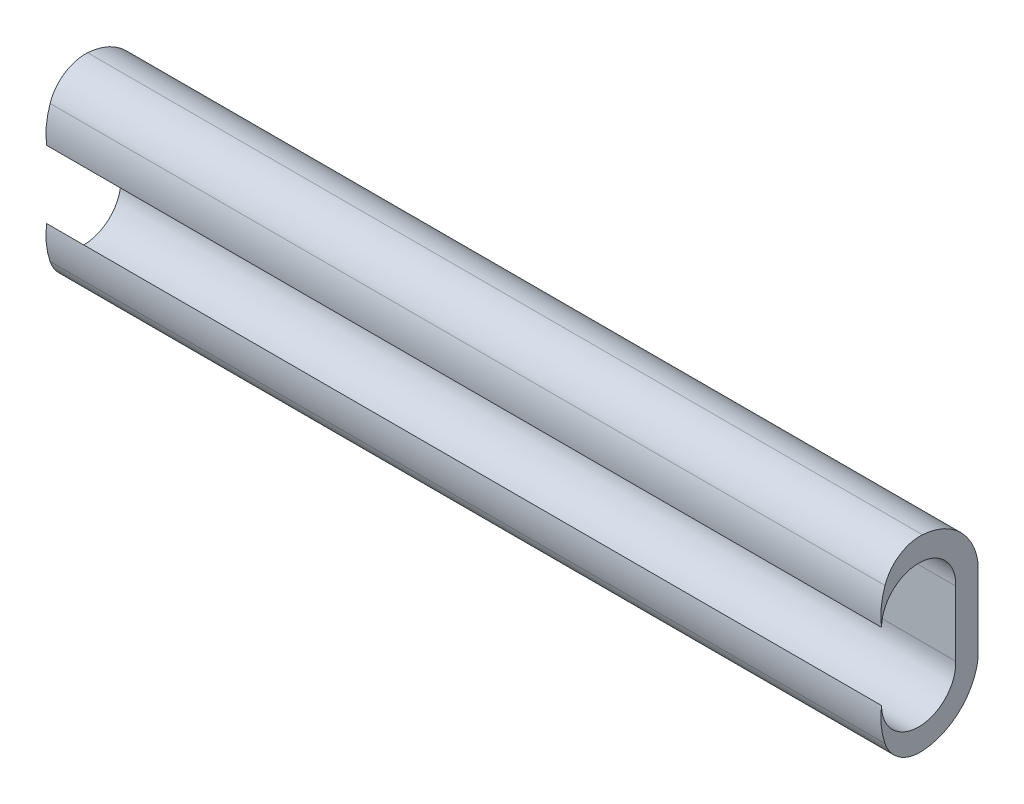
ISO-10303-21;
HEADER;
FILE_DESCRIPTION(('STEP AP214'),'2;1');
FILE_NAME('part.step','',(''),(''),'','','');
FILE_SCHEMA(('AUTOMOTIVE_DESIGN { 1 0 10303 214 1 1 1 1 }'));
ENDSEC;
DATA;
#1=APPLICATION_CONTEXT('core data for automotive mechanical design processes');
#2=APPLICATION_PROTOCOL_DEFINITION('international standard','automotive_design',2000,#1);
#3=PRODUCT_CONTEXT('',#1,'mechanical');
#4=PRODUCT('Part','Part','',(#3));
#5=PRODUCT_RELATED_PRODUCT_CATEGORY('part','',(#4));
#6=PRODUCT_DEFINITION_FORMATION('','',#4);
#7=PRODUCT_DEFINITION_CONTEXT('part definition',#1,'design');
#8=PRODUCT_DEFINITION('design','',#6,#7);
#9=PRODUCT_DEFINITION_SHAPE('','',#8);
#10=(LENGTH_UNIT() NAMED_UNIT(*) SI_UNIT(.MILLI.,.METRE.));
#11=(NAMED_UNIT(*) PLANE_ANGLE_UNIT() SI_UNIT($,.RADIAN.));
#12=(NAMED_UNIT(*) SI_UNIT($,.STERADIAN.) SOLID_ANGLE_UNIT());
#13=UNCERTAINTY_MEASURE_WITH_UNIT(LENGTH_MEASURE(1.E-05),#10,'distance_accuracy_value','');
#14=(GEOMETRIC_REPRESENTATION_CONTEXT(3) GLOBAL_UNCERTAINTY_ASSIGNED_CONTEXT((#13)) GLOBAL_UNIT_ASSIGNED_CONTEXT((#10,
#11,#12)) REPRESENTATION_CONTEXT('',''));
#15=CARTESIAN_POINT('',(0.,0.,0.));
#16=DIRECTION('',(0.,0.,1.));
#17=DIRECTION('',(1.,0.,0.));
#18=AXIS2_PLACEMENT_3D('',#15,#16,#17);
#19=CARTESIAN_POINT('',(-45.,3.04837819199576,1.91991245588261));
#20=DIRECTION('',(1.,0.,0.));
#21=DIRECTION('',(0.,0.,-1.));
#22=AXIS2_PLACEMENT_3D('',#19,#20,#21);
#23=CYLINDRICAL_SURFACE('',#22,2.);
#24=CARTESIAN_POINT('',(0.,3.04837819199576,1.91991245588261));
#25=DIRECTION('',(1.,0.,0.));
#26=DIRECTION('',(0.,0.,-1.));
#27=AXIS2_PLACEMENT_3D('',#24,#25,#26);
#28=CIRCLE('',#27,2.);
#29=CARTESIAN_POINT('',(0.,3.68763119707454,3.81499968223863));
#30=VERTEX_POINT('',#29);
#31=CARTESIAN_POINT('',(0.,5.04424708328357,1.79143145032311));
#32=VERTEX_POINT('',#31);
#33=EDGE_CURVE('E135',#30,#32,#28,.F.);
#34=ORIENTED_EDGE('',*,*,#33,.T.);
#35=DIRECTION('',(1.,0.,0.));
#36=VECTOR('',#35,1.);
#37=CARTESIAN_POINT('',(-45.,5.04424708328357,1.79143145032311));
#38=LINE('',#37,#36);
#39=CARTESIAN_POINT('',(-45.,5.04424708328357,1.79143145032311));
#40=VERTEX_POINT('',#39);
#41=EDGE_CURVE('E11',#40,#32,#38,.T.);
#42=ORIENTED_EDGE('',*,*,#41,.F.);
#43=CARTESIAN_POINT('',(-45.,3.04837819199576,1.91991245588261));
#44=DIRECTION('',(1.,0.,0.));
#45=DIRECTION('',(0.,0.,-1.));
#46=AXIS2_PLACEMENT_3D('',#43,#44,#45);
#47=CIRCLE('',#46,2.);
#48=CARTESIAN_POINT('',(-45.,3.68763119707454,3.81499968223863));
#49=VERTEX_POINT('',#48);
#50=EDGE_CURVE('E57',#49,#40,#47,.F.);
#51=ORIENTED_EDGE('',*,*,#50,.F.);
#52=DIRECTION('',(1.,0.,0.));
#53=VECTOR('',#52,1.);
#54=CARTESIAN_POINT('',(-45.,3.68763119707454,3.81499968223863));
#55=LINE('',#54,#53);
#56=EDGE_CURVE('E42',#49,#30,#55,.T.);
#57=ORIENTED_EDGE('',*,*,#56,.T.);
#58=EDGE_LOOP('',(#34,#42,#51,#57));
#59=FACE_BOUND('',#58,.T.);
#60=ADVANCED_FACE('F39',(#59),#23,.T.);
#61=CARTESIAN_POINT('',(-45.,1.82392596743135,1.99873469403578));
#62=DIRECTION('',(1.,0.,0.));
#63=DIRECTION('',(0.,0.,-1.));
#64=AXIS2_PLACEMENT_3D('',#61,#62,#63);
#65=CYLINDRICAL_SURFACE('',#64,3.22698663214732);
#66=CARTESIAN_POINT('',(0.,1.82392596743135,1.99873469403578));
#67=DIRECTION('',(1.,0.,0.));
#68=DIRECTION('',(0.,0.,-1.));
#69=AXIS2_PLACEMENT_3D('',#66,#67,#68);
#70=CIRCLE('',#69,3.22698663214732);
#71=CARTESIAN_POINT('',(0.,2.25,-1.2));
#72=VERTEX_POINT('',#71);
#73=EDGE_CURVE('E151',#72,#32,#70,.T.);
#74=ORIENTED_EDGE('',*,*,#73,.F.);
#75=DIRECTION('',(1.,0.,0.));
#76=VECTOR('',#75,1.);
#77=CARTESIAN_POINT('',(-45.,2.25,-1.2));
#78=LINE('',#77,#76);
#79=CARTESIAN_POINT('',(-45.,2.25,-1.2));
#80=VERTEX_POINT('',#79);
#81=EDGE_CURVE('E48',#80,#72,#78,.T.);
#82=ORIENTED_EDGE('',*,*,#81,.F.);
#83=CARTESIAN_POINT('',(-45.,1.82392596743135,1.99873469403578));
#84=DIRECTION('',(1.,0.,0.));
#85=DIRECTION('',(0.,0.,-1.));
#86=AXIS2_PLACEMENT_3D('',#83,#84,#85);
#87=CIRCLE('',#86,3.22698663214732);
#88=EDGE_CURVE('E133',#80,#40,#87,.T.);
#89=ORIENTED_EDGE('',*,*,#88,.T.);
#90=ORIENTED_EDGE('',*,*,#41,.T.);
#91=EDGE_LOOP('',(#74,#82,#89,#90));
#92=FACE_BOUND('',#91,.T.);
#93=ADVANCED_FACE('F167',(#92),#65,.T.);
#94=CARTESIAN_POINT('',(-45.,0.,-1.2));
#95=DIRECTION('',(0.,0.,-1.));
#96=DIRECTION('',(-1.,0.,0.));
#97=AXIS2_PLACEMENT_3D('',#94,#95,#96);
#98=PLANE('',#97);
#99=DIRECTION('',(0.,1.,0.));
#100=VECTOR('',#99,1.);
#101=CARTESIAN_POINT('',(0.,0.,-1.2));
#102=LINE('',#101,#100);
#103=CARTESIAN_POINT('',(0.,-2.25,-1.2));
#104=VERTEX_POINT('',#103);
#105=EDGE_CURVE('E149',#104,#72,#102,.T.);
#106=ORIENTED_EDGE('',*,*,#105,.F.);
#107=DIRECTION('',(1.,0.,0.));
#108=VECTOR('',#107,1.);
#109=CARTESIAN_POINT('',(-45.,-2.25,-1.2));
#110=LINE('',#109,#108);
#111=CARTESIAN_POINT('',(-45.,-2.25,-1.2));
#112=VERTEX_POINT('',#111);
#113=EDGE_CURVE('E322',#112,#104,#110,.T.);
#114=ORIENTED_EDGE('',*,*,#113,.F.);
#115=DIRECTION('',(0.,1.,0.));
#116=VECTOR('',#115,1.);
#117=CARTESIAN_POINT('',(-45.,0.,-1.2));
#118=LINE('',#117,#116);
#119=EDGE_CURVE('E111',#112,#80,#118,.T.);
#120=ORIENTED_EDGE('',*,*,#119,.T.);
#121=ORIENTED_EDGE('',*,*,#81,.T.);
#122=EDGE_LOOP('',(#106,#114,#120,#121));
#123=FACE_BOUND('',#122,.T.);
#124=ADVANCED_FACE('F171',(#123),#98,.T.);
#125=CARTESIAN_POINT('',(-45.,0.,0.));
#126=DIRECTION('',(0.,0.,-1.));
#127=DIRECTION('',(-1.,0.,0.));
#128=AXIS2_PLACEMENT_3D('',#125,#126,#127);
#129=PLANE('',#128);
#130=DIRECTION('',(0.,1.,0.));
#131=VECTOR('',#130,1.);
#132=CARTESIAN_POINT('',(0.,0.,0.));
#133=LINE('',#132,#131);
#134=CARTESIAN_POINT('',(0.,-1.75279494144631,0.));
#135=VERTEX_POINT('',#134);
#136=CARTESIAN_POINT('',(0.,1.75279494144631,0.));
#137=VERTEX_POINT('',#136);
#138=EDGE_CURVE('E117',#135,#137,#133,.T.);
#139=ORIENTED_EDGE('',*,*,#138,.T.);
#140=DIRECTION('',(1.,0.,0.));
#141=VECTOR('',#140,1.);
#142=CARTESIAN_POINT('',(-45.,1.75279494144631,0.));
#143=LINE('',#142,#141);
#144=CARTESIAN_POINT('',(-45.,1.75279494144631,0.));
#145=VERTEX_POINT('',#144);
#146=EDGE_CURVE('E114',#145,#137,#143,.T.);
#147=ORIENTED_EDGE('',*,*,#146,.F.);
#148=DIRECTION('',(0.,1.,0.));
#149=VECTOR('',#148,1.);
#150=CARTESIAN_POINT('',(-45.,0.,0.));
#151=LINE('',#150,#149);
#152=CARTESIAN_POINT('',(-45.,-1.75279494144631,0.));
#153=VERTEX_POINT('',#152);
#154=EDGE_CURVE('E98',#153,#145,#151,.T.);
#155=ORIENTED_EDGE('',*,*,#154,.F.);
#156=DIRECTION('',(1.,0.,0.));
#157=VECTOR('',#156,1.);
#158=CARTESIAN_POINT('',(-45.,-1.75279494144631,0.));
#159=LINE('',#158,#157);
#160=EDGE_CURVE('E325',#153,#135,#159,.T.);
#161=ORIENTED_EDGE('',*,*,#160,.T.);
#162=EDGE_LOOP('',(#139,#147,#155,#161));
#163=FACE_BOUND('',#162,.T.);
#164=ADVANCED_FACE('F115',(#163),#129,.F.);
#165=CARTESIAN_POINT('',(-45.,1.82392596743135,1.99873469403578));
#166=DIRECTION('',(1.,0.,0.));
#167=DIRECTION('',(0.,0.,-1.));
#168=AXIS2_PLACEMENT_3D('',#165,#166,#167);
#169=CYLINDRICAL_SURFACE('',#168,2.);
#170=CARTESIAN_POINT('',(0.,1.82392596743135,1.99873469403578));
#171=DIRECTION('',(1.,0.,0.));
#172=DIRECTION('',(0.,0.,-1.));
#173=AXIS2_PLACEMENT_3D('',#170,#171,#172);
#174=CIRCLE('',#173,2.);
#175=CARTESIAN_POINT('',(0.,1.82392596743134,3.99873469403578));
#176=VERTEX_POINT('',#175);
#177=EDGE_CURVE('E143',#137,#176,#174,.T.);
#178=ORIENTED_EDGE('',*,*,#177,.T.);
#179=DIRECTION('',(1.,0.,0.));
#180=VECTOR('',#179,1.);
#181=CARTESIAN_POINT('',(-45.,1.82392596743134,3.99873469403578));
#182=LINE('',#181,#180);
#183=CARTESIAN_POINT('',(-45.,1.82392596743134,3.99873469403578));
#184=VERTEX_POINT('',#183);
#185=EDGE_CURVE('E121',#184,#176,#182,.T.);
#186=ORIENTED_EDGE('',*,*,#185,.F.);
#187=CARTESIAN_POINT('',(-45.,1.82392596743135,1.99873469403578));
#188=DIRECTION('',(1.,0.,0.));
#189=DIRECTION('',(0.,0.,-1.));
#190=AXIS2_PLACEMENT_3D('',#187,#188,#189);
#191=CIRCLE('',#190,2.);
#192=EDGE_CURVE('E102',#145,#184,#191,.T.);
#193=ORIENTED_EDGE('',*,*,#192,.F.);
#194=ORIENTED_EDGE('',*,*,#146,.T.);
#195=EDGE_LOOP('',(#178,#186,#193,#194));
#196=FACE_BOUND('',#195,.T.);
#197=ADVANCED_FACE('F123',(#196),#169,.F.);
#198=CARTESIAN_POINT('',(-45.,3.68763119707454,3.81499968223863));
#199=CARTESIAN_POINT('',(-45.,2.71633840059157,4.14263728663376));
#200=CARTESIAN_POINT('',(-45.,1.71378640995213,4.10335856162983));
#201=CARTESIAN_POINT('',(-45.,0.793955669736873,3.71313289336614));
#202=B_SPLINE_CURVE_WITH_KNOTS('',3,(#198,#199,#200,#201),.UNSPECIFIED.,.F.,.F.,(4,4),
(0.27184632039241,1.),.UNSPECIFIED.);
#203=DIRECTION('',(1.,0.,0.));
#204=VECTOR('',#203,1.);
#205=SURFACE_OF_LINEAR_EXTRUSION('',#202,#204);
#206=CARTESIAN_POINT('',(0.,3.68763119707454,3.81499968223863));
#207=CARTESIAN_POINT('',(0.,2.71633840059157,4.14263728663376));
#208=CARTESIAN_POINT('',(0.,1.71378640995213,4.10335856162983));
#209=CARTESIAN_POINT('',(0.,0.793955669736873,3.71313289336614));
#210=B_SPLINE_CURVE_WITH_KNOTS('',3,(#206,#207,#208,#209),.UNSPECIFIED.,.F.,.F.,(4,4),
(0.27184632039241,1.),.UNSPECIFIED.);
#211=EDGE_CURVE('E137',#30,#176,#210,.T.);
#212=ORIENTED_EDGE('',*,*,#211,.F.);
#213=ORIENTED_EDGE('',*,*,#56,.F.);
#214=EDGE_CURVE('E124',#49,#184,#202,.T.);
#215=ORIENTED_EDGE('',*,*,#214,.T.);
#216=ORIENTED_EDGE('',*,*,#185,.T.);
#217=EDGE_LOOP('',(#212,#213,#215,#216));
#218=FACE_BOUND('',#217,.T.);
#219=ADVANCED_FACE('F158',(#218),#205,.T.);
#220=CARTESIAN_POINT('',(-45.,0.,0.));
#221=DIRECTION('',(1.,0.,0.));
#222=DIRECTION('',(0.,0.,-1.));
#223=AXIS2_PLACEMENT_3D('',#220,#221,#222);
#224=PLANE('',#223);
#225=ORIENTED_EDGE('',*,*,#50,.T.);
#226=ORIENTED_EDGE('',*,*,#88,.F.);
#227=ORIENTED_EDGE('',*,*,#119,.F.);
#228=CARTESIAN_POINT('',(-45.,-1.82392596743135,1.99873469403578));
#229=DIRECTION('',(-1.,0.,0.));
#230=DIRECTION('',(0.,0.,-1.));
#231=AXIS2_PLACEMENT_3D('',#228,#229,#230);
#232=CIRCLE('',#231,3.22698663214732);
#233=CARTESIAN_POINT('',(-45.,-5.04424708328357,1.79143145032311));
#234=VERTEX_POINT('',#233);
#235=EDGE_CURVE('E300',#112,#234,#232,.T.);
#236=ORIENTED_EDGE('',*,*,#235,.T.);
#237=CARTESIAN_POINT('',(-45.,-3.04837819199576,1.91991245588261));
#238=DIRECTION('',(-1.,0.,0.));
#239=DIRECTION('',(0.,0.,-1.));
#240=AXIS2_PLACEMENT_3D('',#237,#238,#239);
#241=CIRCLE('',#240,2.);
#242=CARTESIAN_POINT('',(-45.,-3.68763119707454,3.81499968223863));
#243=VERTEX_POINT('',#242);
#244=EDGE_CURVE('E295',#243,#234,#241,.F.);
#245=ORIENTED_EDGE('',*,*,#244,.F.);
#246=CARTESIAN_POINT('',(-45.,-3.68763119707454,3.81499968223863));
#247=CARTESIAN_POINT('',(-45.,-2.71633840059157,4.14263728663376));
#248=CARTESIAN_POINT('',(-45.,-1.71378640995213,4.10335856162983));
#249=CARTESIAN_POINT('',(-45.,-0.793955669736873,3.71313289336614));
#250=B_SPLINE_CURVE_WITH_KNOTS('',3,(#246,#247,#248,#249),.UNSPECIFIED.,.F.,.F.,(4,4),
(0.27184632039241,1.),.UNSPECIFIED.);
#251=CARTESIAN_POINT('',(-45.,-1.82392596743134,3.99873469403578));
#252=VERTEX_POINT('',#251);
#253=EDGE_CURVE('E289',#243,#252,#250,.T.);
#254=ORIENTED_EDGE('',*,*,#253,.T.);
#255=CARTESIAN_POINT('',(-45.,-1.82392596743135,1.99873469403578));
#256=DIRECTION('',(-1.,0.,0.));
#257=DIRECTION('',(0.,0.,-1.));
#258=AXIS2_PLACEMENT_3D('',#255,#256,#257);
#259=CIRCLE('',#258,2.);
#260=EDGE_CURVE('E107',#153,#252,#259,.T.);
#261=ORIENTED_EDGE('',*,*,#260,.F.);
#262=ORIENTED_EDGE('',*,*,#154,.T.);
#263=ORIENTED_EDGE('',*,*,#192,.T.);
#264=ORIENTED_EDGE('',*,*,#214,.F.);
#265=EDGE_LOOP('',(#225,#226,#227,#236,#245,#254,#261,#262,#263,#264));
#266=FACE_BOUND('',#265,.T.);
#267=ADVANCED_FACE('F100',(#266),#224,.F.);
#268=CARTESIAN_POINT('',(0.,0.,0.));
#269=DIRECTION('',(1.,0.,0.));
#270=DIRECTION('',(0.,0.,-1.));
#271=AXIS2_PLACEMENT_3D('',#268,#269,#270);
#272=PLANE('',#271);
#273=ORIENTED_EDGE('',*,*,#33,.F.);
#274=ORIENTED_EDGE('',*,*,#211,.T.);
#275=ORIENTED_EDGE('',*,*,#177,.F.);
#276=ORIENTED_EDGE('',*,*,#138,.F.);
#277=CARTESIAN_POINT('',(0.,-1.82392596743135,1.99873469403578));
#278=DIRECTION('',(-1.,0.,0.));
#279=DIRECTION('',(0.,0.,-1.));
#280=AXIS2_PLACEMENT_3D('',#277,#278,#279);
#281=CIRCLE('',#280,2.);
#282=CARTESIAN_POINT('',(0.,-1.82392596743134,3.99873469403578));
#283=VERTEX_POINT('',#282);
#284=EDGE_CURVE('E311',#135,#283,#281,.T.);
#285=ORIENTED_EDGE('',*,*,#284,.T.);
#286=CARTESIAN_POINT('',(0.,-3.68763119707454,3.81499968223863));
#287=CARTESIAN_POINT('',(0.,-2.71633840059157,4.14263728663376));
#288=CARTESIAN_POINT('',(0.,-1.71378640995213,4.10335856162983));
#289=CARTESIAN_POINT('',(0.,-0.793955669736873,3.71313289336614));
#290=B_SPLINE_CURVE_WITH_KNOTS('',3,(#286,#287,#288,#289),.UNSPECIFIED.,.F.,.F.,(4,4),
(0.27184632039241,1.),.UNSPECIFIED.);
#291=CARTESIAN_POINT('',(0.,-3.68763119707454,3.81499968223863));
#292=VERTEX_POINT('',#291);
#293=EDGE_CURVE('E307',#292,#283,#290,.T.);
#294=ORIENTED_EDGE('',*,*,#293,.F.);
#295=CARTESIAN_POINT('',(0.,-3.04837819199576,1.91991245588261));
#296=DIRECTION('',(-1.,0.,0.));
#297=DIRECTION('',(0.,0.,-1.));
#298=AXIS2_PLACEMENT_3D('',#295,#296,#297);
#299=CIRCLE('',#298,2.);
#300=CARTESIAN_POINT('',(0.,-5.04424708328357,1.79143145032311));
#301=VERTEX_POINT('',#300);
#302=EDGE_CURVE('E304',#292,#301,#299,.F.);
#303=ORIENTED_EDGE('',*,*,#302,.T.);
#304=CARTESIAN_POINT('',(0.,-1.82392596743135,1.99873469403578));
#305=DIRECTION('',(-1.,0.,0.));
#306=DIRECTION('',(0.,0.,-1.));
#307=AXIS2_PLACEMENT_3D('',#304,#305,#306);
#308=CIRCLE('',#307,3.22698663214732);
#309=EDGE_CURVE('E317',#104,#301,#308,.T.);
#310=ORIENTED_EDGE('',*,*,#309,.F.);
#311=ORIENTED_EDGE('',*,*,#105,.T.);
#312=ORIENTED_EDGE('',*,*,#73,.T.);
#313=EDGE_LOOP('',(#273,#274,#275,#276,#285,#294,#303,#310,#311,#312));
#314=FACE_BOUND('',#313,.T.);
#315=ADVANCED_FACE('F157',(#314),#272,.T.);
#316=CARTESIAN_POINT('',(-45.,-3.04837819199576,1.91991245588261));
#317=DIRECTION('',(1.,0.,0.));
#318=DIRECTION('',(0.,0.,-1.));
#319=AXIS2_PLACEMENT_3D('',#316,#317,#318);
#320=CYLINDRICAL_SURFACE('',#319,2.);
#321=ORIENTED_EDGE('',*,*,#302,.F.);
#322=DIRECTION('',(1.,0.,0.));
#323=VECTOR('',#322,1.);
#324=CARTESIAN_POINT('',(-45.,-3.68763119707454,3.81499968223863));
#325=LINE('',#324,#323);
#326=EDGE_CURVE('E303',#243,#292,#325,.T.);
#327=ORIENTED_EDGE('',*,*,#326,.F.);
#328=ORIENTED_EDGE('',*,*,#244,.T.);
#329=DIRECTION('',(1.,0.,0.));
#330=VECTOR('',#329,1.);
#331=CARTESIAN_POINT('',(-45.,-5.04424708328357,1.79143145032311));
#332=LINE('',#331,#330);
#333=EDGE_CURVE('E138',#234,#301,#332,.T.);
#334=ORIENTED_EDGE('',*,*,#333,.T.);
#335=EDGE_LOOP('',(#321,#327,#328,#334));
#336=FACE_BOUND('',#335,.T.);
#337=ADVANCED_FACE('F229',(#336),#320,.T.);
#338=CARTESIAN_POINT('',(-45.,-1.82392596743135,1.99873469403578));
#339=DIRECTION('',(1.,0.,0.));
#340=DIRECTION('',(0.,0.,-1.));
#341=AXIS2_PLACEMENT_3D('',#338,#339,#340);
#342=CYLINDRICAL_SURFACE('',#341,3.22698663214732);
#343=ORIENTED_EDGE('',*,*,#309,.T.);
#344=ORIENTED_EDGE('',*,*,#333,.F.);
#345=ORIENTED_EDGE('',*,*,#235,.F.);
#346=ORIENTED_EDGE('',*,*,#113,.T.);
#347=EDGE_LOOP('',(#343,#344,#345,#346));
#348=FACE_BOUND('',#347,.T.);
#349=ADVANCED_FACE('F239',(#348),#342,.T.);
#350=CARTESIAN_POINT('',(-45.,-1.82392596743135,1.99873469403578));
#351=DIRECTION('',(1.,0.,0.));
#352=DIRECTION('',(0.,0.,-1.));
#353=AXIS2_PLACEMENT_3D('',#350,#351,#352);
#354=CYLINDRICAL_SURFACE('',#353,2.);
#355=ORIENTED_EDGE('',*,*,#284,.F.);
#356=ORIENTED_EDGE('',*,*,#160,.F.);
#357=ORIENTED_EDGE('',*,*,#260,.T.);
#358=DIRECTION('',(1.,0.,0.));
#359=VECTOR('',#358,1.);
#360=CARTESIAN_POINT('',(-45.,-1.82392596743134,3.99873469403578));
#361=LINE('',#360,#359);
#362=EDGE_CURVE('E327',#252,#283,#361,.T.);
#363=ORIENTED_EDGE('',*,*,#362,.T.);
#364=EDGE_LOOP('',(#355,#356,#357,#363));
#365=FACE_BOUND('',#364,.T.);
#366=ADVANCED_FACE('F249',(#365),#354,.F.);
#367=DIRECTION('',(1.,0.,0.));
#368=VECTOR('',#367,1.);
#369=SURFACE_OF_LINEAR_EXTRUSION('',#250,#368);
#370=ORIENTED_EDGE('',*,*,#293,.T.);
#371=ORIENTED_EDGE('',*,*,#362,.F.);
#372=ORIENTED_EDGE('',*,*,#253,.F.);
#373=ORIENTED_EDGE('',*,*,#326,.T.);
#374=EDGE_LOOP('',(#370,#371,#372,#373));
#375=FACE_BOUND('',#374,.T.);
#376=ADVANCED_FACE('F259',(#375),#369,.F.);
#377=CLOSED_SHELL('',(#60,#93,#124,#164,#197,#219,#267,#315,#337,#349,#366,#376));
#378=MANIFOLD_SOLID_BREP('B2',#377);
#379=ADVANCED_BREP_SHAPE_REPRESENTATION('',(#18,#378),#14);
#380=SHAPE_DEFINITION_REPRESENTATION(#9,#379);
ENDSEC;
END-ISO-10303-21;
